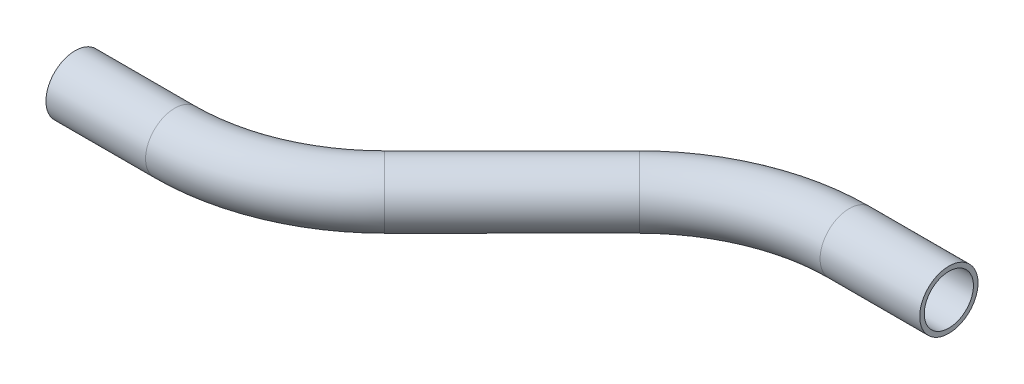
ISO-10303-21;
HEADER;
FILE_DESCRIPTION(('STEP AP214'),'2;1');
FILE_NAME('part.step','',(''),(''),'','','');
FILE_SCHEMA(('AUTOMOTIVE_DESIGN { 1 0 10303 214 1 1 1 1 }'));
ENDSEC;
DATA;
#1=APPLICATION_CONTEXT('core data for automotive mechanical design processes');
#2=APPLICATION_PROTOCOL_DEFINITION('international standard','automotive_design',2000,#1);
#3=PRODUCT_CONTEXT('',#1,'mechanical');
#4=PRODUCT('Part','Part','',(#3));
#5=PRODUCT_RELATED_PRODUCT_CATEGORY('part','',(#4));
#6=PRODUCT_DEFINITION_FORMATION('','',#4);
#7=PRODUCT_DEFINITION_CONTEXT('part definition',#1,'design');
#8=PRODUCT_DEFINITION('design','',#6,#7);
#9=PRODUCT_DEFINITION_SHAPE('','',#8);
#10=(LENGTH_UNIT() NAMED_UNIT(*) SI_UNIT(.MILLI.,.METRE.));
#11=(NAMED_UNIT(*) PLANE_ANGLE_UNIT() SI_UNIT($,.RADIAN.));
#12=(NAMED_UNIT(*) SI_UNIT($,.STERADIAN.) SOLID_ANGLE_UNIT());
#13=UNCERTAINTY_MEASURE_WITH_UNIT(LENGTH_MEASURE(1.E-05),#10,'distance_accuracy_value','');
#14=(GEOMETRIC_REPRESENTATION_CONTEXT(3) GLOBAL_UNCERTAINTY_ASSIGNED_CONTEXT((#13)) GLOBAL_UNIT_ASSIGNED_CONTEXT((#10,
#11,#12)) REPRESENTATION_CONTEXT('',''));
#15=CARTESIAN_POINT('',(0.,0.,0.));
#16=DIRECTION('',(0.,0.,1.));
#17=DIRECTION('',(1.,0.,0.));
#18=AXIS2_PLACEMENT_3D('',#15,#16,#17);
#19=CARTESIAN_POINT('',(0.,0.,0.));
#20=DIRECTION('',(1.,0.,0.));
#21=DIRECTION('',(0.,0.,-1.));
#22=AXIS2_PLACEMENT_3D('',#19,#20,#21);
#23=CYLINDRICAL_SURFACE('',#22,7.9375);
#24=CARTESIAN_POINT('',(27.1276949103776,0.,0.));
#25=DIRECTION('',(1.,0.,0.));
#26=DIRECTION('',(0.,0.,-1.));
#27=AXIS2_PLACEMENT_3D('',#24,#25,#26);
#28=CIRCLE('',#27,7.9375);
#29=CARTESIAN_POINT('',(27.1276949103776,0.,7.9375));
#30=VERTEX_POINT('',#29);
#31=EDGE_CURVE('E56',#30,#30,#28,.T.);
#32=ORIENTED_EDGE('',*,*,#31,.F.);
#33=EDGE_LOOP('',(#32));
#34=FACE_BOUND('',#33,.T.);
#35=CARTESIAN_POINT('',(0.,0.,0.));
#36=DIRECTION('',(1.,0.,0.));
#37=DIRECTION('',(0.,0.,-1.));
#38=AXIS2_PLACEMENT_3D('',#35,#36,#37);
#39=CIRCLE('',#38,7.9375);
#40=CARTESIAN_POINT('',(0.,0.,-7.9375));
#41=VERTEX_POINT('',#40);
#42=EDGE_CURVE('E53',#41,#41,#39,.T.);
#43=ORIENTED_EDGE('',*,*,#42,.T.);
#44=EDGE_LOOP('',(#43));
#45=FACE_BOUND('',#44,.T.);
#46=ADVANCED_FACE('F32',(#34,#45),#23,.T.);
#47=CARTESIAN_POINT('',(27.1276949103776,0.,-57.15));
#48=DIRECTION('',(0.,1.,0.));
#49=DIRECTION('',(0.,0.,1.));
#50=AXIS2_PLACEMENT_3D('',#47,#48,#49);
#51=TOROIDAL_SURFACE('',#50,57.15,7.9375);
#52=CARTESIAN_POINT('',(67.5388474551888,0.,-16.7388474551889));
#53=DIRECTION('',(0.707106781186546,0.,-0.707106781186549));
#54=DIRECTION('',(-0.707106781186549,0.,-0.707106781186546));
#55=AXIS2_PLACEMENT_3D('',#52,#53,#54);
#56=CIRCLE('',#55,7.9375);
#57=CARTESIAN_POINT('',(73.1515075308571,0.,-11.1261873795207));
#58=VERTEX_POINT('',#57);
#59=EDGE_CURVE('E59',#58,#58,#56,.T.);
#60=CARTESIAN_POINT('',(27.1276949103776,0.,-57.15));
#61=DIRECTION('',(0.,1.,0.));
#62=DIRECTION('',(0.,0.,1.));
#63=AXIS2_PLACEMENT_3D('',#60,#61,#62);
#64=CIRCLE('',#63,65.0875);
#65=EDGE_CURVE('',#30,#58,#64,.T.);
#66=ORIENTED_EDGE('',*,*,#31,.T.);
#67=ORIENTED_EDGE('',*,*,#59,.F.);
#68=ORIENTED_EDGE('',*,*,#65,.T.);
#69=ORIENTED_EDGE('',*,*,#65,.F.);
#70=EDGE_LOOP('',(#66,#68,#67,#69));
#71=FACE_BOUND('',#70,.T.);
#72=ADVANCED_FACE('F78',(#71),#51,.T.);
#73=CARTESIAN_POINT('',(67.5388474551888,0.,-16.7388474551889));
#74=DIRECTION('',(0.707106781186547,0.,-0.707106781186549));
#75=DIRECTION('',(-0.707106781186549,0.,-0.707106781186547));
#76=AXIS2_PLACEMENT_3D('',#73,#74,#75);
#77=CYLINDRICAL_SURFACE('',#76,7.9375);
#78=CARTESIAN_POINT('',(102.217293956411,0.,-51.4172939564111));
#79=DIRECTION('',(0.707106781186547,0.,-0.707106781186549));
#80=DIRECTION('',(-0.707106781186549,0.,-0.707106781186547));
#81=AXIS2_PLACEMENT_3D('',#78,#79,#80);
#82=CIRCLE('',#81,7.9375);
#83=CARTESIAN_POINT('',(96.6046338807427,0.,-57.0299540320793));
#84=VERTEX_POINT('',#83);
#85=EDGE_CURVE('E61',#84,#84,#82,.T.);
#86=ORIENTED_EDGE('',*,*,#85,.F.);
#87=EDGE_LOOP('',(#86));
#88=FACE_BOUND('',#87,.T.);
#89=ORIENTED_EDGE('',*,*,#59,.T.);
#90=EDGE_LOOP('',(#89));
#91=FACE_BOUND('',#90,.T.);
#92=ADVANCED_FACE('F71',(#88,#91),#77,.T.);
#93=CARTESIAN_POINT('',(142.628446501222,0.,-11.0061414116));
#94=DIRECTION('',(0.,-1.,0.));
#95=DIRECTION('',(0.,0.,-1.));
#96=AXIS2_PLACEMENT_3D('',#93,#94,#95);
#97=TOROIDAL_SURFACE('',#96,57.15,7.9375);
#98=CARTESIAN_POINT('',(142.628446501222,0.,-68.1561414116));
#99=DIRECTION('',(1.,0.,0.));
#100=DIRECTION('',(0.,0.,-1.));
#101=AXIS2_PLACEMENT_3D('',#98,#99,#100);
#102=CIRCLE('',#101,7.9375);
#103=CARTESIAN_POINT('',(142.628446501222,0.,-76.0936414116));
#104=VERTEX_POINT('',#103);
#105=EDGE_CURVE('E36',#104,#104,#102,.T.);
#106=CARTESIAN_POINT('',(142.628446501222,0.,-11.0061414116));
#107=DIRECTION('',(0.,-1.,0.));
#108=DIRECTION('',(0.,0.,-1.));
#109=AXIS2_PLACEMENT_3D('',#106,#107,#108);
#110=CIRCLE('',#109,65.0875);
#111=EDGE_CURVE('',#84,#104,#110,.T.);
#112=ORIENTED_EDGE('',*,*,#85,.T.);
#113=ORIENTED_EDGE('',*,*,#105,.F.);
#114=ORIENTED_EDGE('',*,*,#111,.T.);
#115=ORIENTED_EDGE('',*,*,#111,.F.);
#116=EDGE_LOOP('',(#112,#114,#113,#115));
#117=FACE_BOUND('',#116,.T.);
#118=ADVANCED_FACE('F69',(#117),#97,.T.);
#119=CARTESIAN_POINT('',(142.628446501222,0.,-68.1561414116));
#120=DIRECTION('',(1.,0.,0.));
#121=DIRECTION('',(0.,0.,-1.));
#122=AXIS2_PLACEMENT_3D('',#119,#120,#121);
#123=CYLINDRICAL_SURFACE('',#122,7.9375);
#124=CARTESIAN_POINT('',(169.7561414116,0.,-68.1561414116));
#125=DIRECTION('',(1.,0.,0.));
#126=DIRECTION('',(0.,0.,-1.));
#127=AXIS2_PLACEMENT_3D('',#124,#125,#126);
#128=CIRCLE('',#127,7.9375);
#129=CARTESIAN_POINT('',(169.7561414116,0.,-76.0936414116));
#130=VERTEX_POINT('',#129);
#131=EDGE_CURVE('E49',#130,#130,#128,.T.);
#132=ORIENTED_EDGE('',*,*,#131,.F.);
#133=EDGE_LOOP('',(#132));
#134=FACE_BOUND('',#133,.T.);
#135=ORIENTED_EDGE('',*,*,#105,.T.);
#136=EDGE_LOOP('',(#135));
#137=FACE_BOUND('',#136,.T.);
#138=ADVANCED_FACE('F34',(#134,#137),#123,.T.);
#139=CARTESIAN_POINT('',(0.,0.,0.));
#140=DIRECTION('',(1.,0.,0.));
#141=DIRECTION('',(0.,0.,-1.));
#142=AXIS2_PLACEMENT_3D('',#139,#140,#141);
#143=PLANE('',#142);
#144=CARTESIAN_POINT('',(0.,0.,0.));
#145=DIRECTION('',(1.,0.,0.));
#146=DIRECTION('',(0.,0.,-1.));
#147=AXIS2_PLACEMENT_3D('',#144,#145,#146);
#148=CIRCLE('',#147,6.6929);
#149=CARTESIAN_POINT('',(0.,0.,-6.6929));
#150=VERTEX_POINT('',#149);
#151=EDGE_CURVE('E52',#150,#150,#148,.F.);
#152=ORIENTED_EDGE('',*,*,#151,.F.);
#153=EDGE_LOOP('',(#152));
#154=FACE_BOUND('',#153,.T.);
#155=ORIENTED_EDGE('',*,*,#42,.F.);
#156=EDGE_LOOP('',(#155));
#157=FACE_BOUND('',#156,.T.);
#158=ADVANCED_FACE('F76',(#154,#157),#143,.F.);
#159=CARTESIAN_POINT('',(169.7561414116,0.,-68.1561414116));
#160=DIRECTION('',(1.,0.,0.));
#161=DIRECTION('',(0.,0.,-1.));
#162=AXIS2_PLACEMENT_3D('',#159,#160,#161);
#163=PLANE('',#162);
#164=CARTESIAN_POINT('',(169.7561414116,0.,-68.1561414116));
#165=DIRECTION('',(1.,0.,0.));
#166=DIRECTION('',(0.,0.,-1.));
#167=AXIS2_PLACEMENT_3D('',#164,#165,#166);
#168=CIRCLE('',#167,6.6929);
#169=CARTESIAN_POINT('',(169.7561414116,0.,-74.8490414116));
#170=VERTEX_POINT('',#169);
#171=EDGE_CURVE('E10',#170,#170,#168,.F.);
#172=ORIENTED_EDGE('',*,*,#171,.T.);
#173=EDGE_LOOP('',(#172));
#174=FACE_BOUND('',#173,.T.);
#175=ORIENTED_EDGE('',*,*,#131,.T.);
#176=EDGE_LOOP('',(#175));
#177=FACE_BOUND('',#176,.T.);
#178=ADVANCED_FACE('F95',(#174,#177),#163,.T.);
#179=CARTESIAN_POINT('',(0.,0.,0.));
#180=DIRECTION('',(1.,0.,0.));
#181=DIRECTION('',(0.,0.,-1.));
#182=AXIS2_PLACEMENT_3D('',#179,#180,#181);
#183=CYLINDRICAL_SURFACE('',#182,6.6929);
#184=CARTESIAN_POINT('',(27.1276949103776,0.,0.));
#185=DIRECTION('',(1.,0.,0.));
#186=DIRECTION('',(0.,0.,-1.));
#187=AXIS2_PLACEMENT_3D('',#184,#185,#186);
#188=CIRCLE('',#187,6.6929);
#189=CARTESIAN_POINT('',(27.1276949103776,0.,6.6929));
#190=VERTEX_POINT('',#189);
#191=EDGE_CURVE('E191',#190,#190,#188,.F.);
#192=ORIENTED_EDGE('',*,*,#191,.F.);
#193=EDGE_LOOP('',(#192));
#194=FACE_BOUND('',#193,.T.);
#195=ORIENTED_EDGE('',*,*,#151,.T.);
#196=EDGE_LOOP('',(#195));
#197=FACE_BOUND('',#196,.T.);
#198=ADVANCED_FACE('F98',(#194,#197),#183,.F.);
#199=CARTESIAN_POINT('',(27.1276949103776,0.,-57.15));
#200=DIRECTION('',(0.,1.,0.));
#201=DIRECTION('',(0.,0.,1.));
#202=AXIS2_PLACEMENT_3D('',#199,#200,#201);
#203=TOROIDAL_SURFACE('',#202,57.15,6.6929);
#204=CARTESIAN_POINT('',(67.5388474551888,0.,-16.7388474551889));
#205=DIRECTION('',(0.707106781186546,0.,-0.707106781186549));
#206=DIRECTION('',(-0.707106781186549,0.,-0.707106781186546));
#207=AXIS2_PLACEMENT_3D('',#204,#205,#206);
#208=CIRCLE('',#207,6.6929);
#209=CARTESIAN_POINT('',(72.2714424309923,0.,-12.0062524793854));
#210=VERTEX_POINT('',#209);
#211=EDGE_CURVE('E190',#210,#210,#208,.F.);
#212=CARTESIAN_POINT('',(27.1276949103776,0.,-57.15));
#213=DIRECTION('',(0.,1.,0.));
#214=DIRECTION('',(0.,0.,1.));
#215=AXIS2_PLACEMENT_3D('',#212,#213,#214);
#216=CIRCLE('',#215,63.8429);
#217=EDGE_CURVE('',#190,#210,#216,.T.);
#218=ORIENTED_EDGE('',*,*,#191,.T.);
#219=ORIENTED_EDGE('',*,*,#211,.F.);
#220=ORIENTED_EDGE('',*,*,#217,.T.);
#221=ORIENTED_EDGE('',*,*,#217,.F.);
#222=EDGE_LOOP('',(#218,#220,#219,#221));
#223=FACE_BOUND('',#222,.T.);
#224=ADVANCED_FACE('F153',(#223),#203,.F.);
#225=CARTESIAN_POINT('',(67.5388474551888,0.,-16.7388474551889));
#226=DIRECTION('',(0.707106781186547,0.,-0.707106781186549));
#227=DIRECTION('',(-0.707106781186549,0.,-0.707106781186547));
#228=AXIS2_PLACEMENT_3D('',#225,#226,#227);
#229=CYLINDRICAL_SURFACE('',#228,6.6929);
#230=CARTESIAN_POINT('',(102.217293956411,0.,-51.4172939564111));
#231=DIRECTION('',(0.707106781186547,0.,-0.707106781186549));
#232=DIRECTION('',(-0.707106781186549,0.,-0.707106781186547));
#233=AXIS2_PLACEMENT_3D('',#230,#231,#232);
#234=CIRCLE('',#233,6.6929);
#235=CARTESIAN_POINT('',(97.4846989806074,0.,-56.1498889322145));
#236=VERTEX_POINT('',#235);
#237=EDGE_CURVE('E45',#236,#236,#234,.F.);
#238=ORIENTED_EDGE('',*,*,#237,.F.);
#239=EDGE_LOOP('',(#238));
#240=FACE_BOUND('',#239,.T.);
#241=ORIENTED_EDGE('',*,*,#211,.T.);
#242=EDGE_LOOP('',(#241));
#243=FACE_BOUND('',#242,.T.);
#244=ADVANCED_FACE('F89',(#240,#243),#229,.F.);
#245=CARTESIAN_POINT('',(142.628446501222,0.,-11.0061414116));
#246=DIRECTION('',(0.,-1.,0.));
#247=DIRECTION('',(0.,0.,-1.));
#248=AXIS2_PLACEMENT_3D('',#245,#246,#247);
#249=TOROIDAL_SURFACE('',#248,57.15,6.6929);
#250=CARTESIAN_POINT('',(142.628446501222,0.,-68.1561414116));
#251=DIRECTION('',(1.,0.,0.));
#252=DIRECTION('',(0.,0.,-1.));
#253=AXIS2_PLACEMENT_3D('',#250,#251,#252);
#254=CIRCLE('',#253,6.6929);
#255=CARTESIAN_POINT('',(142.628446501222,0.,-74.8490414116));
#256=VERTEX_POINT('',#255);
#257=EDGE_CURVE('E40',#256,#256,#254,.F.);
#258=CARTESIAN_POINT('',(142.628446501222,0.,-11.0061414116));
#259=DIRECTION('',(0.,-1.,0.));
#260=DIRECTION('',(0.,0.,-1.));
#261=AXIS2_PLACEMENT_3D('',#258,#259,#260);
#262=CIRCLE('',#261,63.8429);
#263=EDGE_CURVE('',#236,#256,#262,.T.);
#264=ORIENTED_EDGE('',*,*,#237,.T.);
#265=ORIENTED_EDGE('',*,*,#257,.F.);
#266=ORIENTED_EDGE('',*,*,#263,.T.);
#267=ORIENTED_EDGE('',*,*,#263,.F.);
#268=EDGE_LOOP('',(#264,#266,#265,#267));
#269=FACE_BOUND('',#268,.T.);
#270=ADVANCED_FACE('F83',(#269),#249,.F.);
#271=CARTESIAN_POINT('',(142.628446501222,0.,-68.1561414116));
#272=DIRECTION('',(1.,0.,0.));
#273=DIRECTION('',(0.,0.,-1.));
#274=AXIS2_PLACEMENT_3D('',#271,#272,#273);
#275=CYLINDRICAL_SURFACE('',#274,6.6929);
#276=ORIENTED_EDGE('',*,*,#171,.F.);
#277=EDGE_LOOP('',(#276));
#278=FACE_BOUND('',#277,.T.);
#279=ORIENTED_EDGE('',*,*,#257,.T.);
#280=EDGE_LOOP('',(#279));
#281=FACE_BOUND('',#280,.T.);
#282=ADVANCED_FACE('F81',(#278,#281),#275,.F.);
#283=CLOSED_SHELL('',(#46,#72,#92,#118,#138,#158,#178,#198,#224,#244,#270,#282));
#284=MANIFOLD_SOLID_BREP('B2',#283);
#285=ADVANCED_BREP_SHAPE_REPRESENTATION('',(#18,#284),#14);
#286=SHAPE_DEFINITION_REPRESENTATION(#9,#285);
ENDSEC;
END-ISO-10303-21;
